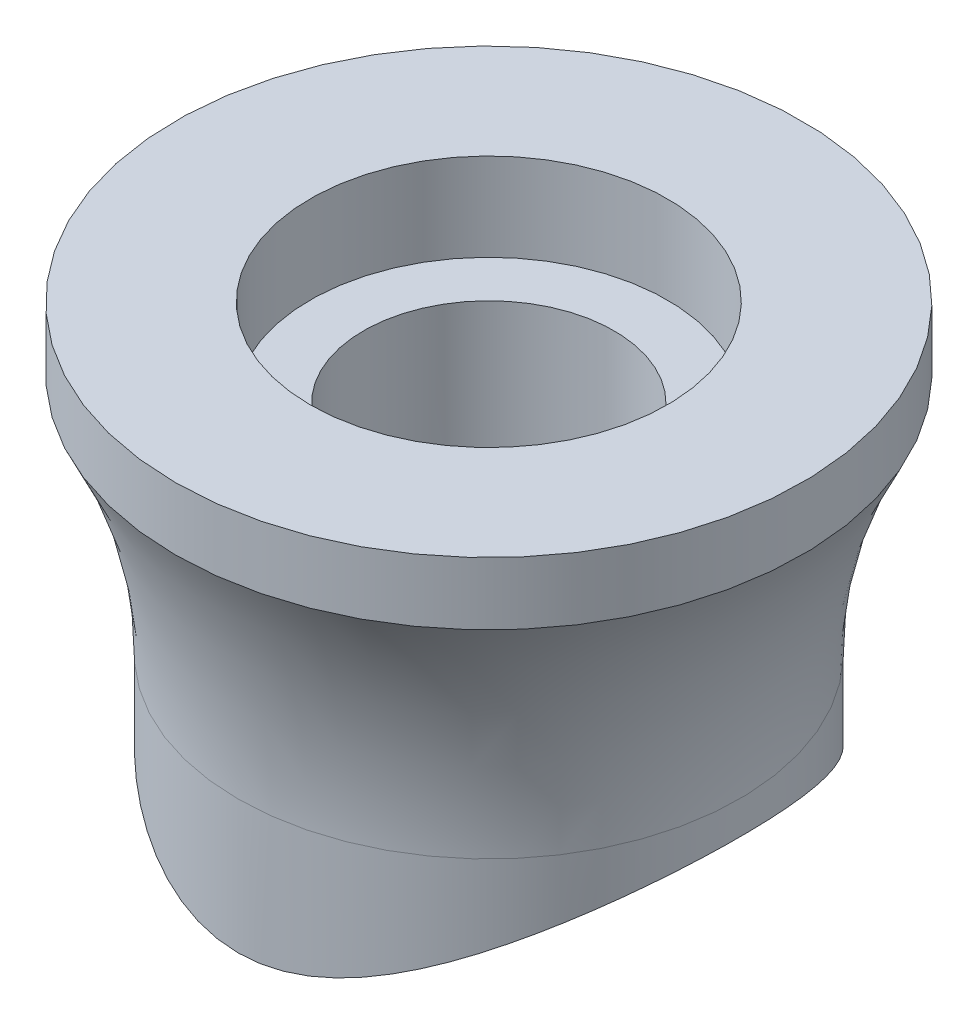
ISO-10303-21;
HEADER;
FILE_DESCRIPTION(('STEP AP214'),'2;1');
FILE_NAME('part.step','',(''),(''),'','','');
FILE_SCHEMA(('AUTOMOTIVE_DESIGN { 1 0 10303 214 1 1 1 1 }'));
ENDSEC;
DATA;
#1=APPLICATION_CONTEXT('core data for automotive mechanical design processes');
#2=APPLICATION_PROTOCOL_DEFINITION('international standard','automotive_design',2000,#1);
#3=PRODUCT_CONTEXT('',#1,'mechanical');
#4=PRODUCT('Part','Part','',(#3));
#5=PRODUCT_RELATED_PRODUCT_CATEGORY('part','',(#4));
#6=PRODUCT_DEFINITION_FORMATION('','',#4);
#7=PRODUCT_DEFINITION_CONTEXT('part definition',#1,'design');
#8=PRODUCT_DEFINITION('design','',#6,#7);
#9=PRODUCT_DEFINITION_SHAPE('','',#8);
#10=(LENGTH_UNIT() NAMED_UNIT(*) SI_UNIT(.MILLI.,.METRE.));
#11=(NAMED_UNIT(*) PLANE_ANGLE_UNIT() SI_UNIT($,.RADIAN.));
#12=(NAMED_UNIT(*) SI_UNIT($,.STERADIAN.) SOLID_ANGLE_UNIT());
#13=UNCERTAINTY_MEASURE_WITH_UNIT(LENGTH_MEASURE(1.E-05),#10,'distance_accuracy_value','');
#14=(GEOMETRIC_REPRESENTATION_CONTEXT(3) GLOBAL_UNCERTAINTY_ASSIGNED_CONTEXT((#13)) GLOBAL_UNIT_ASSIGNED_CONTEXT((#10,
#11,#12)) REPRESENTATION_CONTEXT('',''));
#15=CARTESIAN_POINT('',(0.,0.,0.));
#16=DIRECTION('',(0.,0.,1.));
#17=DIRECTION('',(1.,0.,0.));
#18=AXIS2_PLACEMENT_3D('',#15,#16,#17);
#19=CARTESIAN_POINT('',(0.,-22.,0.));
#20=DIRECTION('',(0.,-1.,0.));
#21=DIRECTION('',(0.,0.,-1.));
#22=AXIS2_PLACEMENT_3D('',#19,#20,#21);
#23=CONICAL_SURFACE('',#22,10.,0.63107938747133);
#24=CARTESIAN_POINT('',(0.,-22.,0.));
#25=DIRECTION('',(0.,1.,0.));
#26=DIRECTION('',(0.,0.,1.));
#27=AXIS2_PLACEMENT_3D('',#24,#25,#26);
#28=CIRCLE('',#27,10.);
#29=CARTESIAN_POINT('',(0.,-22.,10.));
#30=VERTEX_POINT('',#29);
#31=EDGE_CURVE('E28',#30,#30,#28,.T.);
#32=ORIENTED_EDGE('',*,*,#31,.T.);
#33=EDGE_LOOP('',(#32));
#34=FACE_BOUND('',#33,.T.);
#35=CARTESIAN_POINT('',(-8.18111837213107,-30.6900179338991,-14.156440506485));
#36=CARTESIAN_POINT('',(-8.57350024484808,-30.4497764566354,-13.726912653437));
#37=CARTESIAN_POINT('',(-8.94775581293136,-30.2134006616926,-13.2785754705842));
#38=CARTESIAN_POINT('',(-9.66001676949581,-29.754608201209,-12.3470347395841));
#39=CARTESIAN_POINT('',(-9.99800893712334,-29.5321966389019,-11.8638185819903));
#40=CARTESIAN_POINT('',(-10.6351725340878,-29.1071075884176,-10.8658129150399));
#41=CARTESIAN_POINT('',(-10.9344253934843,-28.9043889373544,-10.3510930969792));
#42=CARTESIAN_POINT('',(-11.4919655102676,-28.5230221605493,-9.29152741678138));
#43=CARTESIAN_POINT('',(-11.7502666493882,-28.3443658812953,-8.74669184804598));
#44=CARTESIAN_POINT('',(-12.1772148413038,-28.0470392325872,-7.7365265889891));
#45=CARTESIAN_POINT('',(-12.3535623398835,-27.9234294812026,-7.27589313392496));
#46=CARTESIAN_POINT('',(-12.6750415519387,-27.6971491534931,-6.3388358950829));
#47=CARTESIAN_POINT('',(-12.8201762874026,-27.5944765501044,-5.86241364511959));
#48=CARTESIAN_POINT('',(-13.0771360353068,-27.4121600234775,-4.89660701687674));
#49=CARTESIAN_POINT('',(-13.1889790341825,-27.3325036659993,-4.40722979394426));
#50=CARTESIAN_POINT('',(-13.377676030014,-27.1978557609378,-3.41839557424061));
#51=CARTESIAN_POINT('',(-13.4545297911425,-27.1428643795964,-2.91893850955505));
#52=CARTESIAN_POINT('',(-13.5721260864582,-27.0586400122288,-1.91158001923346));
#53=CARTESIAN_POINT('',(-13.6127233344208,-27.0295106626236,-1.40365285456439));
#54=CARTESIAN_POINT('',(-13.6565153495369,-26.9980867009734,-0.385350377068304));
#55=CARTESIAN_POINT('',(-13.6597100437588,-26.9957921412539,0.125024940530445));
#56=CARTESIAN_POINT('',(-13.6286347520408,-27.0180941843338,1.14407748506994));
#57=CARTESIAN_POINT('',(-13.5943616550383,-27.0426930201722,1.65275456748313));
#58=CARTESIAN_POINT('',(-13.4889951222691,-27.1181921353048,2.66428075812446));
#59=CARTESIAN_POINT('',(-13.4179026495164,-27.1690917267005,3.1671300184281));
#60=CARTESIAN_POINT('',(-13.2456556140084,-27.2920933746532,4.13257703980248));
#61=CARTESIAN_POINT('',(-13.1466197851981,-27.3626982385958,4.59574779513789));
#62=CARTESIAN_POINT('',(-12.9186964977329,-27.524649884482,5.51093294511579));
#63=CARTESIAN_POINT('',(-12.7898103995998,-27.6159957210855,5.96294784718336));
#64=CARTESIAN_POINT('',(-12.5038378377904,-27.8177900034602,6.85358064335894));
#65=CARTESIAN_POINT('',(-12.3467498958214,-27.928239450599,7.29219783377067));
#66=CARTESIAN_POINT('',(-12.0061158769676,-28.1664003705552,8.15418372559733));
#67=CARTESIAN_POINT('',(-11.8225684939478,-28.2941126955121,8.57755167296351));
#68=CARTESIAN_POINT('',(-11.4113912118199,-28.5781784337753,9.44847284951105));
#69=CARTESIAN_POINT('',(-11.1811999423707,-28.7361139259831,9.89430022060789));
#70=CARTESIAN_POINT('',(-10.6928932327549,-29.0677375824392,10.7642933590502));
#71=CARTESIAN_POINT('',(-10.434774337975,-29.2414276950843,11.188456436974));
#72=CARTESIAN_POINT('',(-9.89183443028659,-29.6019180523357,12.0143474674075));
#73=CARTESIAN_POINT('',(-9.60697885162488,-29.7887351872155,12.416045275816));
#74=CARTESIAN_POINT('',(-9.01184917080913,-30.1721520382633,13.1950995970302));
#75=CARTESIAN_POINT('',(-8.70157929946951,-30.3687501240282,13.5724601427331));
#76=CARTESIAN_POINT('',(-8.10562045178589,-30.7373109266994,14.2449999751149));
#77=CARTESIAN_POINT('',(-7.82353831829011,-30.9083877874231,14.5438693618293));
#78=CARTESIAN_POINT('',(-7.24063184338257,-31.2524047843074,15.1218246786228));
#79=CARTESIAN_POINT('',(-6.93980318132641,-31.4253453423545,15.4009060160894));
#80=CARTESIAN_POINT('',(-6.3188752846468,-31.7692380109227,15.9364727304134));
#81=CARTESIAN_POINT('',(-5.99882028358874,-31.9401936817167,16.1930068640858));
#82=CARTESIAN_POINT('',(-5.3368303476825,-32.2756109636357,16.6805489910367));
#83=CARTESIAN_POINT('',(-4.99491191784571,-32.4400773254355,16.911575889072));
#84=CARTESIAN_POINT('',(-4.29797860614284,-32.7500089698924,17.3350599822439));
#85=CARTESIAN_POINT('',(-3.94381918230571,-32.8959333354709,17.5285707899112));
#86=CARTESIAN_POINT('',(-3.20870981444783,-33.1649595261079,17.8776212608372));
#87=CARTESIAN_POINT('',(-2.82778450130007,-33.2880819644861,18.0331952603009));
#88=CARTESIAN_POINT('',(-2.10913208516498,-33.4777427367526,18.2692862231662));
#89=CARTESIAN_POINT('',(-1.77593158656378,-33.5504718302471,18.3582647628416));
#90=CARTESIAN_POINT('',(-1.09526984063831,-33.6602930943658,18.4917612893211));
#91=CARTESIAN_POINT('',(-0.747844073733116,-33.6974688945286,18.5363836219444));
#92=CARTESIAN_POINT('',(-0.0456995629494833,-33.7294459722144,18.5748018144046));
#93=CARTESIAN_POINT('',(0.30905218993849,-33.7239658123195,18.5682601004215));
#94=CARTESIAN_POINT('',(1.0109432700496,-33.6711066972095,18.5046470247719));
#95=CARTESIAN_POINT('',(1.35806980354008,-33.6236621289745,18.4474965341074));
#96=CARTESIAN_POINT('',(2.13644415683981,-33.4763228777551,18.2674777847223));
#97=CARTESIAN_POINT('',(2.56200960681652,-33.3650262801165,18.1301204019974));
#98=CARTESIAN_POINT('',(3.38183163354532,-33.1075136309106,17.8038520557385));
#99=CARTESIAN_POINT('',(3.77597642411517,-32.9611797238795,17.6147667816151));
#100=CARTESIAN_POINT('',(4.51922149093293,-32.6558345199023,17.207908738557));
#101=CARTESIAN_POINT('',(4.869520922884,-32.4976192015698,16.9916840179916));
#102=CARTESIAN_POINT('',(5.54730792572694,-32.1719102855288,16.5318384885159));
#103=CARTESIAN_POINT('',(5.87477489318941,-32.004408546491,16.2881934413877));
#104=CARTESIAN_POINT('',(6.5099162538621,-31.6655067027828,15.777409761627));
#105=CARTESIAN_POINT('',(6.81754671903063,-31.4940990118557,15.5102218919754));
#106=CARTESIAN_POINT('',(7.41382071996677,-31.1516628993981,14.9554831325174));
#107=CARTESIAN_POINT('',(7.70246871270629,-30.9806343980147,14.66793705586));
#108=CARTESIAN_POINT('',(8.37907775841055,-30.5707482029613,13.9494953030146));
#109=CARTESIAN_POINT('',(8.75793495137139,-30.3335175655742,13.5090458955359));
#110=CARTESIAN_POINT('',(9.4798378048569,-29.871937847763,12.593159978365));
#111=CARTESIAN_POINT('',(9.82286958842,-29.6475937739755,12.1177100319041));
#112=CARTESIAN_POINT('',(10.4709924323138,-29.2174885695187,11.1348280303083));
#113=CARTESIAN_POINT('',(10.7761417002264,-29.0116990658208,10.6274468925899));
#114=CARTESIAN_POINT('',(11.3463330913823,-28.6231921366889,9.5823266228003));
#115=CARTESIAN_POINT('',(11.6113885345979,-28.4404670521469,9.04459765476651));
#116=CARTESIAN_POINT('',(12.053548518679,-28.1334234402756,8.04216378391624));
#117=CARTESIAN_POINT('',(12.2378765142815,-28.004531209593,7.58203586064925));
#118=CARTESIAN_POINT('',(12.5753285379938,-27.7675034089372,6.64525864946506));
#119=CARTESIAN_POINT('',(12.7284553428742,-27.6593659919253,6.16861083616794));
#120=CARTESIAN_POINT('',(13.0013146810355,-27.4660558362492,5.20162918384722));
#121=CARTESIAN_POINT('',(13.1210701357513,-27.3808673362442,4.71130499449168));
#122=CARTESIAN_POINT('',(13.3254349365294,-27.2351845320294,3.71973864291237));
#123=CARTESIAN_POINT('',(13.41004414344,-27.1746903255899,3.21849643747001));
#124=CARTESIAN_POINT('',(13.5429207730671,-27.079577452147,2.2064841949538));
#125=CARTESIAN_POINT('',(13.5910257695664,-27.0450744383873,1.69568181774783));
#126=CARTESIAN_POINT('',(13.6493617433622,-27.0032234421026,0.670796885223259));
#127=CARTESIAN_POINT('',(13.6595926305038,-26.995875524217,0.156714322099502));
#128=CARTESIAN_POINT('',(13.6419802642774,-27.0085167965492,-0.87049995459272));
#129=CARTESIAN_POINT('',(13.6141336713284,-27.0285083845752,-1.38363158080678));
#130=CARTESIAN_POINT('',(13.5208984858299,-27.0953419656386,-2.40467961501753));
#131=CARTESIAN_POINT('',(13.4555111330013,-27.1421830720153,-2.91259619466866));
#132=CARTESIAN_POINT('',(13.2941642733609,-27.2574812953982,-3.8846486176087));
#133=CARTESIAN_POINT('',(13.2006173347106,-27.3242297262862,-4.34939258289667));
#134=CARTESIAN_POINT('',(12.9834135155655,-27.4787222966725,-5.26818001690075));
#135=CARTESIAN_POINT('',(12.8597581863188,-27.5664653544792,-5.72222403557936));
#136=CARTESIAN_POINT('',(12.5839711676727,-27.7613430947675,-6.61725345876086));
#137=CARTESIAN_POINT('',(12.4318406481165,-27.8684769806118,-7.05823939886574));
#138=CARTESIAN_POINT('',(12.1008315056959,-28.100332333008,-7.92527388309427));
#139=CARTESIAN_POINT('',(11.9219515375594,-28.2250546840935,-8.35132167462383));
#140=CARTESIAN_POINT('',(11.521654871417,-28.5022588565182,-9.225132227777));
#141=CARTESIAN_POINT('',(11.2978452269214,-28.6562356881974,-9.67132371288439));
#142=CARTESIAN_POINT('',(10.8223780782562,-28.9801895520409,-10.5425759443045));
#143=CARTESIAN_POINT('',(10.5707171006053,-29.1501685795247,-10.9676340453637));
#144=CARTESIAN_POINT('',(10.040768570774,-29.503607474745,-11.795941930401));
#145=CARTESIAN_POINT('',(9.76244051890398,-29.6870877457666,-12.1991570395785));
#146=CARTESIAN_POINT('',(9.1805797124269,-30.0642869766553,-12.9818111038762));
#147=CARTESIAN_POINT('',(8.87705057000384,-30.2580044677343,-13.3612534528185));
#148=CARTESIAN_POINT('',(8.27897160073471,-30.6311440972302,-14.0555818740603));
#149=CARTESIAN_POINT('',(7.98695264355158,-30.8098699318998,-14.373026285798));
#150=CARTESIAN_POINT('',(7.38245361696332,-31.16994340842,-14.9864854012933));
#151=CARTESIAN_POINT('',(7.06996772643471,-31.3512917846357,-15.2824939575031));
#152=CARTESIAN_POINT('',(6.42409146600405,-31.7123213962919,-15.849965728822));
#153=CARTESIAN_POINT('',(6.09075553223323,-31.8920056736485,-16.1214886849762));
#154=CARTESIAN_POINT('',(5.40028274350602,-32.2447442220829,-16.6368581881557));
#155=CARTESIAN_POINT('',(5.04316624711802,-32.4178039694967,-16.8807279376803));
#156=CARTESIAN_POINT('',(4.33388110326997,-32.7347221525282,-17.314517379543));
#157=CARTESIAN_POINT('',(3.98403711723976,-32.8798102455084,-17.507295111052));
#158=CARTESIAN_POINT('',(3.25815297589862,-33.1481040830712,-17.8560664262355));
#159=CARTESIAN_POINT('',(2.88213250155563,-33.2713260256742,-18.0120872670092));
#160=CARTESIAN_POINT('',(2.16660649947013,-33.4642701074877,-18.2526945493668));
#161=CARTESIAN_POINT('',(1.83120239925034,-33.5394484723139,-18.3447943782604));
#162=CARTESIAN_POINT('',(1.14550155469521,-33.6539781307315,-18.4841477602389));
#163=CARTESIAN_POINT('',(0.795242462386249,-33.6934149284529,-18.5315083540278));
#164=CARTESIAN_POINT('',(0.0865559348948829,-33.729263442628,-18.574588178577));
#165=CARTESIAN_POINT('',(-0.271912128006872,-33.725363709274,-18.5699335866691));
#166=CARTESIAN_POINT('',(-0.981424661382062,-33.6746119641411,-18.5088720741236));
#167=CARTESIAN_POINT('',(-1.33245725102298,-33.6276958415632,-18.4523879075868));
#168=CARTESIAN_POINT('',(-2.1126834599047,-33.4818086789299,-18.2742235124858));
#169=CARTESIAN_POINT('',(-2.53654528262714,-33.3720075142836,-18.1388039772452));
#170=CARTESIAN_POINT('',(-3.35331610217784,-33.1174329483718,-17.816570717444));
#171=CARTESIAN_POINT('',(-3.74611189143155,-32.9725388116875,-17.6295792475279));
#172=CARTESIAN_POINT('',(-4.51310583278569,-32.6592054908809,-17.2127071343531));
#173=CARTESIAN_POINT('',(-4.88651844652307,-32.4902373833381,-16.9818072296865));
#174=CARTESIAN_POINT('',(-5.60758030242272,-32.1420716559019,-16.4891033278595));
#175=CARTESIAN_POINT('',(-5.95520064532976,-31.9628629480593,-16.2272654924373));
#176=CARTESIAN_POINT('',(-6.62832181153408,-31.6004832709731,-15.6771318818054));
#177=CARTESIAN_POINT('',(-6.95376001147003,-31.4173028643709,-15.3887661965993));
#178=CARTESIAN_POINT('',(-7.58322247040794,-31.0520317731353,-14.7892587335826));
#179=CARTESIAN_POINT('',(-7.88725383849884,-30.8699407452827,-14.4781245877194));
#180=CARTESIAN_POINT('',(-8.18111837213107,-30.6900179338991,-14.156440506485));
#181=B_SPLINE_CURVE_WITH_KNOTS('',3,(#35,#36,#37,#38,#39,#40,#41,#42,#43,#44,#45,#46,#47,#48,
#49,#50,#51,#52,#53,#54,#55,#56,#57,#58,#59,#60,#61,#62,#63,#64,#65,#66,#67,#68,#69,#70,#71,#72,
#73,#74,#75,#76,#77,#78,#79,#80,#81,#82,#83,#84,#85,#86,#87,#88,#89,#90,#91,#92,#93,#94,#95,#96,
#97,#98,#99,#100,#101,#102,#103,#104,#105,#106,#107,#108,#109,#110,#111,#112,#113,#114,#115,
#116,#117,#118,#119,#120,#121,#122,#123,#124,#125,#126,#127,#128,#129,#130,#131,#132,#133,#134,
#135,#136,#137,#138,#139,#140,#141,#142,#143,#144,#145,#146,#147,#148,#149,#150,#151,#152,#153,
#154,#155,#156,#157,#158,#159,#160,#161,#162,#163,#164,#165,#166,#167,#168,#169,#170,#171,#172,
#173,#174,#175,#176,#177,#178,#179,#180),.UNSPECIFIED.,.T.,.F.,(4,2,2,2,2,2,2,2,2,2,2,2,2,2,2,2,
2,2,2,2,2,2,2,2,2,2,2,2,2,2,2,2,2,2,2,2,2,2,2,2,2,2,2,2,2,2,2,2,2,2,2,2,2,2,2,2,2,2,2,2,2,2,2,2,
2,2,2,2,2,2,2,2,4),(0.,1.88785262246431,3.77639119310115,5.66089326589587,7.54475516171405,
9.06871579502028,10.5925288134921,12.1155170651745,13.6385155816398,15.1675899875492,
16.6966673750165,18.2258717359935,19.7550361025216,21.1901164368033,22.6251313755648,
24.0602215573477,25.4953826047148,27.0719188092123,28.6486502527676,30.2274489675943,
31.8059853858647,33.140673983777,34.4756713427085,35.8077069323165,37.1387485573516,
38.4239904483584,39.7080647265261,40.7615492318511,41.8125495592167,42.8704900731324,
43.9300876489016,45.3047906906537,46.6841844595771,48.0053460167212,49.3276847268471,
50.6528577503177,51.9777185118857,53.8580739351887,55.7391550330772,57.6173090492436,
59.4948377280931,61.029806772854,62.5646391523083,64.0984147041149,65.6321963284227,
67.1727631632644,68.7133336652369,70.2540392914294,71.7946940413165,73.229363547607,
74.6639591523192,76.0984958326208,77.5331046823116,79.0987559970868,80.6646027927006,
82.2328665411115,83.8009058901124,85.200702123009,86.6008982238618,87.997580007228,
89.3930810911873,90.6659092117527,91.9377904736481,93.0014288776982,94.0625159835084,
95.1312337842095,96.2015469750127,97.5687782780806,98.9407820059089,100.349728227269,
101.760229997949,103.174561661529,104.588421396244),.UNSPECIFIED.);
#182=CARTESIAN_POINT('',(-8.18111837213107,-30.6900179338991,-14.156440506485));
#183=VERTEX_POINT('',#182);
#184=EDGE_CURVE('E10',#183,#183,#181,.T.);
#185=ORIENTED_EDGE('',*,*,#184,.F.);
#186=EDGE_LOOP('',(#185));
#187=FACE_BOUND('',#186,.T.);
#188=ADVANCED_FACE('F24',(#34,#187),#23,.F.);
#189=CARTESIAN_POINT('',(0.,35.9833333333333,0.));
#190=DIRECTION('',(0.,1.,0.));
#191=DIRECTION('',(0.,0.,1.));
#192=AXIS2_PLACEMENT_3D('',#189,#190,#191);
#193=CYLINDRICAL_SURFACE('',#192,20.);
#194=CARTESIAN_POINT('',(0.,-24.3649167310371,0.));
#195=DIRECTION('',(0.,1.,0.));
#196=DIRECTION('',(0.,0.,1.));
#197=AXIS2_PLACEMENT_3D('',#194,#195,#196);
#198=CIRCLE('',#197,20.);
#199=CARTESIAN_POINT('',(0.,-24.3649167310371,20.));
#200=VERTEX_POINT('',#199);
#201=EDGE_CURVE('E46',#200,#200,#198,.T.);
#202=ORIENTED_EDGE('',*,*,#201,.F.);
#203=EDGE_LOOP('',(#202));
#204=FACE_BOUND('',#203,.T.);
#205=CARTESIAN_POINT('',(0.,-35.,20.));
#206=CARTESIAN_POINT('',(-0.482598554994229,-34.9999919726876,19.9999955349029));
#207=CARTESIAN_POINT('',(-0.965262187489161,-34.9832833243647,19.9824924713369));
#208=CARTESIAN_POINT('',(-1.92586671875957,-34.9173268194791,19.9128878840938));
#209=CARTESIAN_POINT('',(-2.40380664736455,-34.8680724139414,19.8607793969775));
#210=CARTESIAN_POINT('',(-3.35154768941717,-34.7394270408426,19.7230038652708));
#211=CARTESIAN_POINT('',(-3.82133236351847,-34.6599812557753,19.6372757695509));
#212=CARTESIAN_POINT('',(-4.74852632935079,-34.4746192007541,19.4339095463271));
#213=CARTESIAN_POINT('',(-5.20593538955057,-34.3687024359425,19.3162708222712));
#214=CARTESIAN_POINT('',(-6.10108658803301,-34.1359101564081,19.0523528056127));
#215=CARTESIAN_POINT('',(-6.53898901258192,-34.0092763046861,18.9064005149563));
#216=CARTESIAN_POINT('',(-7.39894745629496,-33.7384234953218,18.5867178804129));
#217=CARTESIAN_POINT('',(-7.82100066720753,-33.5942014403533,18.4129826421983));
#218=CARTESIAN_POINT('',(-8.64816393037425,-33.2922375989951,18.0392685565588));
#219=CARTESIAN_POINT('',(-9.05327681821422,-33.1344980888365,17.8392941246032));
#220=CARTESIAN_POINT('',(-9.84602760621132,-32.8091917275448,17.4143055820466));
#221=CARTESIAN_POINT('',(-10.2336642802937,-32.6416241888007,17.1892897184488));
#222=CARTESIAN_POINT('',(-11.0549349204136,-32.2712100361126,16.6751642020603));
#223=CARTESIAN_POINT('',(-11.4852831906054,-32.0671841285611,16.3816476847515));
#224=CARTESIAN_POINT('',(-12.3206496181428,-31.655259627311,15.7629873747891));
#225=CARTESIAN_POINT('',(-12.7256659188983,-31.4473607512069,15.4378412684425));
#226=CARTESIAN_POINT('',(-13.5098304100779,-31.0319237093687,14.7565080809043));
#227=CARTESIAN_POINT('',(-13.8889492221565,-30.8243862052735,14.4002867571601));
#228=CARTESIAN_POINT('',(-14.6195497680066,-30.4140681653907,13.6579648870843));
#229=CARTESIAN_POINT('',(-14.9710296721672,-30.211287945143,13.2718623660605));
#230=CARTESIAN_POINT('',(-15.6985861099058,-29.7827179144132,12.4065651753174));
#231=CARTESIAN_POINT('',(-16.0696168820494,-29.5584298030154,11.9223542198493));
#232=CARTESIAN_POINT('',(-16.7691350395609,-29.1275605204617,10.9165680896786));
#233=CARTESIAN_POINT('',(-17.0976149048594,-28.9209824814024,10.3949863356215));
#234=CARTESIAN_POINT('',(-17.707749944958,-28.531667241596,9.31761317932292));
#235=CARTESIAN_POINT('',(-17.9894778487049,-28.3488931078467,8.7618767905484));
#236=CARTESIAN_POINT('',(-18.3740715852414,-28.0966451367055,7.90515989781503));
#237=CARTESIAN_POINT('',(-18.4959261589997,-28.016221653486,7.61576573759232));
#238=CARTESIAN_POINT('',(-18.7265355656409,-27.8632682202081,7.02965481471143));
#239=CARTESIAN_POINT('',(-18.835287144781,-27.7907402311927,6.73293625520369));
#240=CARTESIAN_POINT('',(-19.0874347781968,-27.621880183157,5.99065052164043));
#241=CARTESIAN_POINT('',(-19.2228259817317,-27.5305553433259,5.5411800602428));
#242=CARTESIAN_POINT('',(-19.4622826215883,-27.3683270874788,4.63046544840667));
#243=CARTESIAN_POINT('',(-19.5663545056279,-27.2974194682933,4.16922374255772));
#244=CARTESIAN_POINT('',(-19.7418207313487,-27.1775195537161,3.23802673943802));
#245=CARTESIAN_POINT('',(-19.8132351856029,-27.1285137701699,2.7680769912333));
#246=CARTESIAN_POINT('',(-19.9224806367831,-27.0534344473861,1.82244455674886));
#247=CARTESIAN_POINT('',(-19.9603105073125,-27.0273616773013,1.34676167872744));
#248=CARTESIAN_POINT('',(-20.0018663735671,-26.9987167626505,0.392324192399591));
#249=CARTESIAN_POINT('',(-20.0055299878625,-26.9961876044946,-0.0864344381118283));
#250=CARTESIAN_POINT('',(-19.978535253989,-27.0148007358415,-1.0425149563901));
#251=CARTESIAN_POINT('',(-19.9478770337945,-27.035942937082,-1.5198368495074));
#252=CARTESIAN_POINT('',(-19.8526822921707,-27.1014221184619,-2.46958383604749));
#253=CARTESIAN_POINT('',(-19.7881376955653,-27.1457646272621,-2.94200773489466));
#254=CARTESIAN_POINT('',(-19.6260819211142,-27.2566598335535,-3.87849752560008));
#255=CARTESIAN_POINT('',(-19.5285706739293,-27.3232125777599,-4.34256339987661));
#256=CARTESIAN_POINT('',(-19.3042242035562,-27.4755116090479,-5.24983652188219));
#257=CARTESIAN_POINT('',(-19.1780381601765,-27.5608318154183,-5.69327671482065));
#258=CARTESIAN_POINT('',(-18.8967484104169,-27.7497567182752,-6.56684675940561));
#259=CARTESIAN_POINT('',(-18.7416453010344,-27.8533610372809,-6.99697688562683));
#260=CARTESIAN_POINT('',(-18.4040973746356,-28.0769840777612,-7.84195168398702));
#261=CARTESIAN_POINT('',(-18.2216516239762,-28.1970033597297,-8.25679583356749));
#262=CARTESIAN_POINT('',(-17.8310205735086,-28.4514368376697,-9.06962409185133));
#263=CARTESIAN_POINT('',(-17.6228321955151,-28.5858527548673,-9.46760617661217));
#264=CARTESIAN_POINT('',(-17.157497723928,-28.8827711351288,-10.2891946414184));
#265=CARTESIAN_POINT('',(-16.8974787830482,-29.0467321449282,-10.7106471430457));
#266=CARTESIAN_POINT('',(-16.3495200543504,-29.3868331063137,-11.5297905395484));
#267=CARTESIAN_POINT('',(-16.0615784922236,-29.5629738316406,-11.9274799218269));
#268=CARTESIAN_POINT('',(-15.4592326036308,-29.9245368719237,-12.6984914924909));
#269=CARTESIAN_POINT('',(-15.1448026414716,-30.1099681063305,-13.0717894397441));
#270=CARTESIAN_POINT('',(-14.4912014015633,-30.4867952675638,-13.7928204469646));
#271=CARTESIAN_POINT('',(-14.1520288921953,-30.6781914910397,-14.1405522325836));
#272=CARTESIAN_POINT('',(-13.3889854782902,-31.0972643686201,-14.8680613207346));
#273=CARTESIAN_POINT('',(-12.9606499641183,-31.3254553553399,-15.242875616897));
#274=CARTESIAN_POINT('',(-12.0729491101759,-31.7799530970281,-15.9551838970536));
#275=CARTESIAN_POINT('',(-11.6135775607815,-32.0062594646912,-16.2926703767453));
#276=CARTESIAN_POINT('',(-10.6649819418738,-32.4507682522742,-16.9287953727888));
#277=CARTESIAN_POINT('',(-10.1757647724274,-32.6689725267081,-17.2274428187859));
#278=CARTESIAN_POINT('',(-9.42052527462252,-32.984915517492,-17.6447268912575));
#279=CARTESIAN_POINT('',(-9.16523445879466,-33.0883268907519,-17.7786960764102));
#280=CARTESIAN_POINT('',(-8.64752488499802,-33.290467563702,-18.036183576702));
#281=CARTESIAN_POINT('',(-8.38510439431794,-33.3891957089351,-18.1596993207995));
#282=CARTESIAN_POINT('',(-7.71242216196847,-33.6317748339753,-18.4585120218398));
#283=CARTESIAN_POINT('',(-7.29751566077373,-33.7718094647246,-18.6265591570078));
#284=CARTESIAN_POINT('',(-6.45262544217398,-34.0346799220628,-18.9358371945386));
#285=CARTESIAN_POINT('',(-6.02264560061671,-34.1575201299216,-19.0770749314187));
#286=CARTESIAN_POINT('',(-5.14959008017893,-34.3819362770173,-19.3310121146676));
#287=CARTESIAN_POINT('',(-4.70653513075764,-34.4835440079757,-19.4437542817179));
#288=CARTESIAN_POINT('',(-3.80889774240329,-34.661904343058,-19.6393290534602));
#289=CARTESIAN_POINT('',(-3.35431542983431,-34.7386572195164,-19.7221619858684));
#290=CARTESIAN_POINT('',(-2.43232456687064,-34.8645836280767,-19.8570600292407));
#291=CARTESIAN_POINT('',(-1.96483564113318,-34.9134912978033,-19.9088287877278));
#292=CARTESIAN_POINT('',(-1.02513992157158,-34.9802151812816,-19.9792652521951));
#293=CARTESIAN_POINT('',(-0.552933257609799,-34.9980322484872,-19.9979338667926));
#294=CARTESIAN_POINT('',(0.391676703946044,-35.0016581850899,-20.0017410859495));
#295=CARTESIAN_POINT('',(0.864079969238691,-34.9874710901597,-19.9868839180555));
#296=CARTESIAN_POINT('',(1.80464945949555,-34.9278272147474,-19.9239903299034));
#297=CARTESIAN_POINT('',(2.27281581521995,-34.882371402643,-19.8759549371592));
#298=CARTESIAN_POINT('',(3.14219116009808,-34.7700314578772,-19.755865228305));
#299=CARTESIAN_POINT('',(3.54438513900972,-34.7065811792597,-19.6876133405451));
#300=CARTESIAN_POINT('',(4.34047150805835,-34.5596971904459,-19.527549998111));
#301=CARTESIAN_POINT('',(4.73436084206245,-34.4762562586166,-19.4357300285985));
#302=CARTESIAN_POINT('',(5.51222160057742,-34.2918983997407,-19.2295974408888));
#303=CARTESIAN_POINT('',(5.89618767875964,-34.1909722688621,-19.1152729724693));
#304=CARTESIAN_POINT('',(6.65286619422124,-33.9743524946515,-18.8652647662201));
#305=CARTESIAN_POINT('',(7.02557604733301,-33.8586554916633,-18.7295761674451));
#306=CARTESIAN_POINT('',(7.92865851993044,-33.5587979616337,-18.3703459344199));
#307=CARTESIAN_POINT('',(8.45216323841079,-33.3677341404161,-18.1352093894619));
#308=CARTESIAN_POINT('',(9.47172111995584,-32.9675570534102,-17.6241861546112));
#309=CARTESIAN_POINT('',(9.96776353616185,-32.7584368023767,-17.3482836645312));
#310=CARTESIAN_POINT('',(10.9320360281229,-32.3288610644443,-16.7574105652615));
#311=CARTESIAN_POINT('',(11.4002196798554,-32.108387739292,-16.4423773038796));
#312=CARTESIAN_POINT('',(12.306852050488,-31.6627282797271,-15.7752382189329));
#313=CARTESIAN_POINT('',(12.7453041100162,-31.4375426785165,-15.4231365717403));
#314=CARTESIAN_POINT('',(13.5982730125291,-30.984397436098,-14.6769635627891));
#315=CARTESIAN_POINT('',(14.0122785931179,-30.756452962775,-14.282297965096));
#316=CARTESIAN_POINT('',(14.8066560711785,-30.3070081363959,-13.4570063668665));
#317=CARTESIAN_POINT('',(15.1870254818642,-30.085508260612,-13.0263777120816));
#318=CARTESIAN_POINT('',(15.9114009695277,-29.6544484219012,-12.1308851212676));
#319=CARTESIAN_POINT('',(16.2554550745775,-29.4448728622897,-11.6660678179281));
#320=CARTESIAN_POINT('',(16.7424135811687,-29.143115531742,-10.9442149938529));
#321=CARTESIAN_POINT('',(16.8998734318032,-29.0446345469741,-10.6995034769956));
#322=CARTESIAN_POINT('',(17.2047785953353,-28.8524330936081,-10.2019967111311));
#323=CARTESIAN_POINT('',(17.3522213074365,-28.758713862907,-9.94919938763593));
#324=CARTESIAN_POINT('',(17.7306803231201,-28.516477010944,-9.26609686973171));
#325=CARTESIAN_POINT('',(17.9524971760115,-28.3726984475763,-8.82894067247729));
#326=CARTESIAN_POINT('',(18.365103138324,-28.1028196314695,-7.93506563313174));
#327=CARTESIAN_POINT('',(18.5558978978068,-27.9767161601398,-7.47835037252454));
#328=CARTESIAN_POINT('',(18.9043715913234,-27.74476404549,-6.54763301226292));
#329=CARTESIAN_POINT('',(19.062063831658,-27.6389072650844,-6.07363794888547));
#330=CARTESIAN_POINT('',(19.3424222503444,-27.4497182020251,-5.11096972314831));
#331=CARTESIAN_POINT('',(19.4650880588144,-27.3663861572347,-4.62229640584533));
#332=CARTESIAN_POINT('',(19.6741964809935,-27.2238272725879,-3.6309703826812));
#333=CARTESIAN_POINT('',(19.7604410051018,-27.1647323031911,-3.12825669147961));
#334=CARTESIAN_POINT('',(19.8943808678086,-27.0727807543963,-2.11532054432337));
#335=CARTESIAN_POINT('',(19.9420760950611,-27.0399242507856,-1.60509806668462));
#336=CARTESIAN_POINT('',(19.9981092101857,-27.0013110776133,-0.581588428599156));
#337=CARTESIAN_POINT('',(20.0064563534389,-26.9955480351805,-0.0683020172894299));
#338=CARTESIAN_POINT('',(19.9836711922544,-27.0112601133477,0.956952051823202));
#339=CARTESIAN_POINT('',(19.9525414395108,-27.0327334734506,1.4689197927186));
#340=CARTESIAN_POINT('',(19.8558538880181,-27.0992414840911,2.44179838139923));
#341=CARTESIAN_POINT('',(19.7936052752635,-27.1420101093461,2.90319948828234));
#342=CARTESIAN_POINT('',(19.637649634684,-27.2487557022559,3.81812004210116));
#343=CARTESIAN_POINT('',(19.5439448254995,-27.3127311741642,4.271640042528));
#344=CARTESIAN_POINT('',(19.3262491172041,-27.4605969224175,5.16806455516354));
#345=CARTESIAN_POINT('',(19.2022546347116,-27.5444895550039,5.61096780455807));
#346=CARTESIAN_POINT('',(18.9254105216204,-27.7305701605501,6.48370663215141));
#347=CARTESIAN_POINT('',(18.7725594252002,-27.8327590628868,6.91354154523318));
#348=CARTESIAN_POINT('',(18.4324227351466,-28.0583230312634,7.77624001413595));
#349=CARTESIAN_POINT('',(18.2439414123867,-28.182418796518,8.20844274711536));
#350=CARTESIAN_POINT('',(17.8391169690447,-28.4462248704667,9.05460732648646));
#351=CARTESIAN_POINT('',(17.6227733922842,-28.5859354348112,9.46856887407302));
#352=CARTESIAN_POINT('',(17.1639749926039,-28.878591124564,10.2768644416435));
#353=CARTESIAN_POINT('',(16.9215191420547,-29.0315367707827,10.6711976882764));
#354=CARTESIAN_POINT('',(16.4121113606753,-29.3482159107604,11.4391862414182));
#355=CARTESIAN_POINT('',(16.1451565034351,-29.511950692623,11.8128390690799));
#356=CARTESIAN_POINT('',(15.5443831212135,-29.8741187828683,12.5957302881561));
#357=CARTESIAN_POINT('',(15.2066523566184,-30.0739587597401,13.0013205348189));
#358=CARTESIAN_POINT('',(14.5022232045504,-30.4807568391938,13.7826805274464));
#359=CARTESIAN_POINT('',(14.1355221660772,-30.6877155922173,14.1584475380368));
#360=CARTESIAN_POINT('',(13.3738647569644,-31.1050501849584,14.8800378278053));
#361=CARTESIAN_POINT('',(12.9788504525532,-31.3154323083375,15.2257963146022));
#362=CARTESIAN_POINT('',(12.1624126644368,-31.7347657398735,15.8855663827325));
#363=CARTESIAN_POINT('',(11.740987884842,-31.9437169772617,16.1995764042769));
#364=CARTESIAN_POINT('',(10.8095740363662,-32.3852778785348,16.8379476899532));
#365=CARTESIAN_POINT('',(10.2956062206171,-32.6169219409761,17.157201545517));
#366=CARTESIAN_POINT('',(9.23520641223188,-33.0640469560018,17.7504961430518));
#367=CARTESIAN_POINT('',(8.68876504545316,-33.2795232004067,18.0245237424811));
#368=CARTESIAN_POINT('',(7.56683098122743,-33.6844423452599,18.5234666464372));
#369=CARTESIAN_POINT('',(6.99143531956942,-33.873965190156,18.7485340844383));
#370=CARTESIAN_POINT('',(5.81289847845082,-34.2175964101876,19.1467035725942));
#371=CARTESIAN_POINT('',(5.20978019538895,-34.3717334017998,19.3198476480354));
#372=CARTESIAN_POINT('',(4.22414055025395,-34.5824455889005,19.5525512885312));
#373=CARTESIAN_POINT('',(3.84882381268393,-34.6534857862632,19.629940169035));
#374=CARTESIAN_POINT('',(3.09141592791955,-34.7769602157186,19.7633723648774));
#375=CARTESIAN_POINT('',(2.70932636965909,-34.8293987527392,19.8194206192354));
#376=CARTESIAN_POINT('',(1.94064722945285,-34.9139774552762,19.9093818502964));
#377=CARTESIAN_POINT('',(1.55406190876068,-34.9461354636202,19.9433142853997));
#378=CARTESIAN_POINT('',(0.778332110403849,-34.9891517493796,19.9886270417512));
#379=CARTESIAN_POINT('',(0.389187216678562,-35.0000064735531,20.000003600837));
#380=CARTESIAN_POINT('',(0.,-35.,20.));
#381=B_SPLINE_CURVE_WITH_KNOTS('',3,(#205,#206,#207,#208,#209,#210,#211,#212,#213,#214,#215,
#216,#217,#218,#219,#220,#221,#222,#223,#224,#225,#226,#227,#228,#229,#230,#231,#232,#233,#234,
#235,#236,#237,#238,#239,#240,#241,#242,#243,#244,#245,#246,#247,#248,#249,#250,#251,#252,#253,
#254,#255,#256,#257,#258,#259,#260,#261,#262,#263,#264,#265,#266,#267,#268,#269,#270,#271,#272,
#273,#274,#275,#276,#277,#278,#279,#280,#281,#282,#283,#284,#285,#286,#287,#288,#289,#290,#291,
#292,#293,#294,#295,#296,#297,#298,#299,#300,#301,#302,#303,#304,#305,#306,#307,#308,#309,#310,
#311,#312,#313,#314,#315,#316,#317,#318,#319,#320,#321,#322,#323,#324,#325,#326,#327,#328,#329,
#330,#331,#332,#333,#334,#335,#336,#337,#338,#339,#340,#341,#342,#343,#344,#345,#346,#347,#348,
#349,#350,#351,#352,#353,#354,#355,#356,#357,#358,#359,#360,#361,#362,#363,#364,#365,#366,#367,
#368,#369,#370,#371,#372,#373,#374,#375,#376,#377,#378,#379,#380),.UNSPECIFIED.,.T.,.F.,(4,2,2,
2,2,2,2,2,2,2,2,2,2,2,2,2,2,2,2,2,2,2,2,2,2,2,2,2,2,2,2,2,2,2,2,2,2,2,2,2,2,2,2,2,2,2,2,2,2,2,2,
2,2,2,2,2,2,2,2,2,2,2,2,2,2,2,2,2,2,2,2,2,2,2,2,2,2,2,2,2,2,2,2,2,2,2,2,4),(0.,1.44731546595482,
2.89492225468727,4.34517007186331,5.79544500250879,7.22987275719448,8.66455348392826,
10.0989930948783,11.5335331853734,13.2103070612894,14.8872036849696,16.5659720450014,
18.2448514409576,20.1920329458995,22.1395581102659,24.0840246456939,25.0560629156076,
26.0283420672841,27.4613744521125,28.8941116159888,30.3259652146769,31.7578668346299,
33.1923823383146,34.626892493202,36.0617446493573,37.4965998234772,38.9017366829798,
40.3068445364206,41.7120003796725,43.1173244077933,44.6807397133207,46.2442544293425,
47.8093001052978,49.3744237383281,51.2120722865103,53.0500896026019,54.8876835824999,
55.8063103915629,56.7251624857955,58.1309863607682,59.5364513664563,60.939796624795,
62.3431265061704,63.7596396932547,65.1761139956646,66.5924096929586,68.0086615302141,
69.245939205686,70.4836645240695,71.722043344938,72.9607043403561,74.7726560068307,
76.5853118061674,78.4009081876593,80.2163002303864,82.0615025388693,83.906841152815,
85.7497078381502,86.6710654074524,87.5926612860891,89.1236039706657,90.6542675111669,
92.1843145838726,93.7143778133956,95.25265885775,96.7909443452668,98.3288679821491,
99.8666922163137,101.267707380058,102.668623749403,104.069705932724,105.470859305591,
106.932108875773,108.393382373494,109.854713399593,111.31621920967,113.007626189487,
114.699188125567,116.394315939286,118.089526993504,120.030675470252,121.97238704637,
123.907976134249,125.841994356978,127.010273729425,128.178282553726,129.345262323928,
130.512436721824),.UNSPECIFIED.);
#382=CARTESIAN_POINT('',(0.,-35.,20.));
#383=VERTEX_POINT('',#382);
#384=EDGE_CURVE('E42',#383,#383,#381,.T.);
#385=ORIENTED_EDGE('',*,*,#384,.F.);
#386=EDGE_LOOP('',(#385));
#387=FACE_BOUND('',#386,.T.);
#388=ADVANCED_FACE('F53',(#204,#387),#193,.T.);
#389=CARTESIAN_POINT('',(0.,35.9833333333333,0.));
#390=DIRECTION('',(0.,1.,0.));
#391=DIRECTION('',(0.,0.,1.));
#392=AXIS2_PLACEMENT_3D('',#389,#390,#391);
#393=CYLINDRICAL_SURFACE('',#392,10.);
#394=ORIENTED_EDGE('',*,*,#31,.F.);
#395=EDGE_LOOP('',(#394));
#396=FACE_BOUND('',#395,.T.);
#397=CARTESIAN_POINT('',(0.,-7.,0.));
#398=DIRECTION('',(0.,1.,0.));
#399=DIRECTION('',(0.,0.,1.));
#400=AXIS2_PLACEMENT_3D('',#397,#398,#399);
#401=CIRCLE('',#400,10.);
#402=CARTESIAN_POINT('',(0.,-7.,10.));
#403=VERTEX_POINT('',#402);
#404=EDGE_CURVE('E36',#403,#403,#401,.T.);
#405=ORIENTED_EDGE('',*,*,#404,.T.);
#406=EDGE_LOOP('',(#405));
#407=FACE_BOUND('',#406,.T.);
#408=ADVANCED_FACE('F58',(#396,#407),#393,.F.);
#409=CARTESIAN_POINT('',(10.,-7.,0.));
#410=DIRECTION('',(0.,-1.,0.));
#411=DIRECTION('',(0.,0.,-1.));
#412=AXIS2_PLACEMENT_3D('',#409,#410,#411);
#413=PLANE('',#412);
#414=ORIENTED_EDGE('',*,*,#404,.F.);
#415=EDGE_LOOP('',(#414));
#416=FACE_BOUND('',#415,.T.);
#417=CARTESIAN_POINT('',(0.,-7.,0.));
#418=DIRECTION('',(0.,1.,0.));
#419=DIRECTION('',(0.,0.,1.));
#420=AXIS2_PLACEMENT_3D('',#417,#418,#419);
#421=CIRCLE('',#420,14.25);
#422=CARTESIAN_POINT('',(0.,-7.,14.25));
#423=VERTEX_POINT('',#422);
#424=EDGE_CURVE('E123',#423,#423,#421,.T.);
#425=ORIENTED_EDGE('',*,*,#424,.T.);
#426=EDGE_LOOP('',(#425));
#427=FACE_BOUND('',#426,.T.);
#428=ADVANCED_FACE('F74',(#416,#427),#413,.F.);
#429=CARTESIAN_POINT('',(0.,35.9833333333333,0.));
#430=DIRECTION('',(0.,1.,0.));
#431=DIRECTION('',(0.,0.,1.));
#432=AXIS2_PLACEMENT_3D('',#429,#430,#431);
#433=CYLINDRICAL_SURFACE('',#432,14.25);
#434=ORIENTED_EDGE('',*,*,#424,.F.);
#435=EDGE_LOOP('',(#434));
#436=FACE_BOUND('',#435,.T.);
#437=CARTESIAN_POINT('',(0.,0.,0.));
#438=DIRECTION('',(0.,1.,0.));
#439=DIRECTION('',(0.,0.,1.));
#440=AXIS2_PLACEMENT_3D('',#437,#438,#439);
#441=CIRCLE('',#440,14.25);
#442=CARTESIAN_POINT('',(0.,0.,14.25));
#443=VERTEX_POINT('',#442);
#444=EDGE_CURVE('E125',#443,#443,#441,.T.);
#445=ORIENTED_EDGE('',*,*,#444,.T.);
#446=EDGE_LOOP('',(#445));
#447=FACE_BOUND('',#446,.T.);
#448=ADVANCED_FACE('F70',(#436,#447),#433,.F.);
#449=CARTESIAN_POINT('',(14.25,0.,0.));
#450=DIRECTION('',(0.,-1.,0.));
#451=DIRECTION('',(0.,0.,-1.));
#452=AXIS2_PLACEMENT_3D('',#449,#450,#451);
#453=PLANE('',#452);
#454=ORIENTED_EDGE('',*,*,#444,.F.);
#455=EDGE_LOOP('',(#454));
#456=FACE_BOUND('',#455,.T.);
#457=CARTESIAN_POINT('',(0.,0.,0.));
#458=DIRECTION('',(0.,1.,0.));
#459=DIRECTION('',(0.,0.,1.));
#460=AXIS2_PLACEMENT_3D('',#457,#458,#459);
#461=CIRCLE('',#460,25.);
#462=CARTESIAN_POINT('',(0.,0.,25.));
#463=VERTEX_POINT('',#462);
#464=EDGE_CURVE('E130',#463,#463,#461,.T.);
#465=ORIENTED_EDGE('',*,*,#464,.T.);
#466=EDGE_LOOP('',(#465));
#467=FACE_BOUND('',#466,.T.);
#468=ADVANCED_FACE('F66',(#456,#467),#453,.F.);
#469=CARTESIAN_POINT('',(0.,35.9833333333333,0.));
#470=DIRECTION('',(0.,1.,0.));
#471=DIRECTION('',(0.,0.,1.));
#472=AXIS2_PLACEMENT_3D('',#469,#470,#471);
#473=CYLINDRICAL_SURFACE('',#472,25.);
#474=ORIENTED_EDGE('',*,*,#464,.F.);
#475=EDGE_LOOP('',(#474));
#476=FACE_BOUND('',#475,.T.);
#477=CARTESIAN_POINT('',(0.,-5.,0.));
#478=DIRECTION('',(0.,1.,0.));
#479=DIRECTION('',(0.,0.,1.));
#480=AXIS2_PLACEMENT_3D('',#477,#478,#479);
#481=CIRCLE('',#480,25.);
#482=CARTESIAN_POINT('',(0.,-5.,25.));
#483=VERTEX_POINT('',#482);
#484=EDGE_CURVE('E132',#483,#483,#481,.T.);
#485=ORIENTED_EDGE('',*,*,#484,.T.);
#486=EDGE_LOOP('',(#485));
#487=FACE_BOUND('',#486,.T.);
#488=ADVANCED_FACE('F62',(#476,#487),#473,.T.);
#489=CARTESIAN_POINT('',(0.,-24.3649167310371,0.));
#490=DIRECTION('',(0.,1.,0.));
#491=DIRECTION('',(0.,0.,1.));
#492=AXIS2_PLACEMENT_3D('',#489,#490,#491);
#493=TOROIDAL_SURFACE('',#492,60.,40.);
#494=ORIENTED_EDGE('',*,*,#484,.F.);
#495=EDGE_LOOP('',(#494));
#496=FACE_BOUND('',#495,.T.);
#497=ORIENTED_EDGE('',*,*,#201,.T.);
#498=EDGE_LOOP('',(#497));
#499=FACE_BOUND('',#498,.T.);
#500=ADVANCED_FACE('F51',(#496,#499),#493,.F.);
#501=CARTESIAN_POINT('',(98.6233364878719,-56.,0.));
#502=DIRECTION('',(-1.,0.,0.));
#503=DIRECTION('',(0.,0.,1.));
#504=AXIS2_PLACEMENT_3D('',#501,#502,#503);
#505=CYLINDRICAL_SURFACE('',#504,29.);
#506=ORIENTED_EDGE('',*,*,#384,.T.);
#507=EDGE_LOOP('',(#506));
#508=FACE_BOUND('',#507,.T.);
#509=ORIENTED_EDGE('',*,*,#184,.T.);
#510=EDGE_LOOP('',(#509));
#511=FACE_BOUND('',#510,.T.);
#512=ADVANCED_FACE('F48',(#508,#511),#505,.F.);
#513=CLOSED_SHELL('',(#188,#388,#408,#428,#448,#468,#488,#500,#512));
#514=MANIFOLD_SOLID_BREP('B2',#513);
#515=ADVANCED_BREP_SHAPE_REPRESENTATION('',(#18,#514),#14);
#516=SHAPE_DEFINITION_REPRESENTATION(#9,#515);
ENDSEC;
END-ISO-10303-21;
